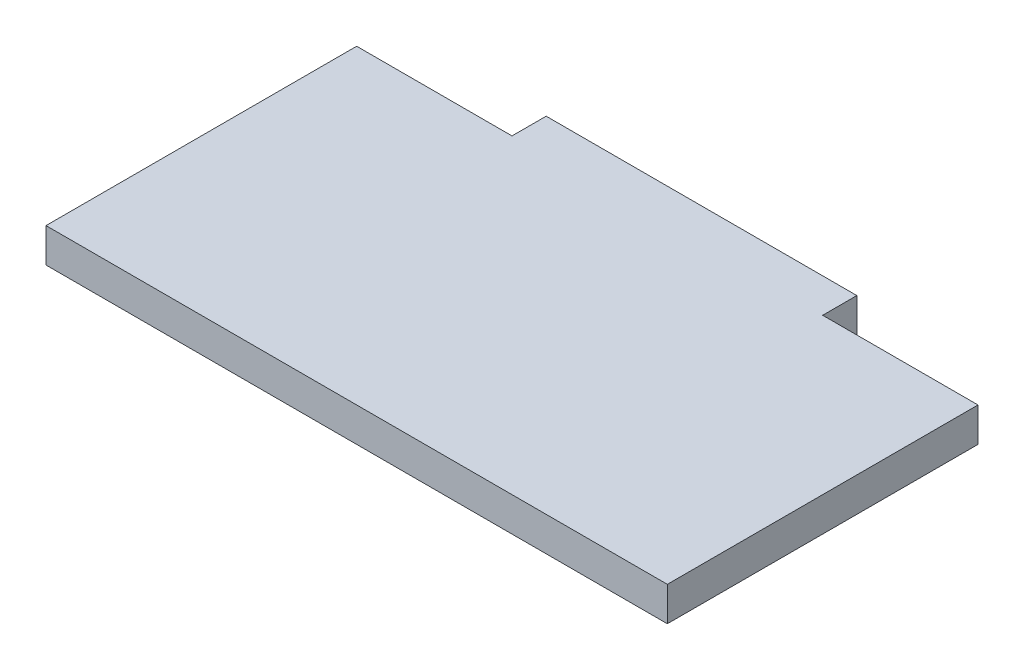
ISO-10303-21;
HEADER;
FILE_DESCRIPTION(('STEP AP214'),'2;1');
FILE_NAME('part.step','',(''),(''),'','','');
FILE_SCHEMA(('AUTOMOTIVE_DESIGN { 1 0 10303 214 1 1 1 1 }'));
ENDSEC;
DATA;
#1=APPLICATION_CONTEXT('core data for automotive mechanical design processes');
#2=APPLICATION_PROTOCOL_DEFINITION('international standard','automotive_design',2000,#1);
#3=PRODUCT_CONTEXT('',#1,'mechanical');
#4=PRODUCT('Part','Part','',(#3));
#5=PRODUCT_RELATED_PRODUCT_CATEGORY('part','',(#4));
#6=PRODUCT_DEFINITION_FORMATION('','',#4);
#7=PRODUCT_DEFINITION_CONTEXT('part definition',#1,'design');
#8=PRODUCT_DEFINITION('design','',#6,#7);
#9=PRODUCT_DEFINITION_SHAPE('','',#8);
#10=(LENGTH_UNIT() NAMED_UNIT(*) SI_UNIT(.MILLI.,.METRE.));
#11=(NAMED_UNIT(*) PLANE_ANGLE_UNIT() SI_UNIT($,.RADIAN.));
#12=(NAMED_UNIT(*) SI_UNIT($,.STERADIAN.) SOLID_ANGLE_UNIT());
#13=UNCERTAINTY_MEASURE_WITH_UNIT(LENGTH_MEASURE(1.E-05),#10,'distance_accuracy_value','');
#14=(GEOMETRIC_REPRESENTATION_CONTEXT(3) GLOBAL_UNCERTAINTY_ASSIGNED_CONTEXT((#13)) GLOBAL_UNIT_ASSIGNED_CONTEXT((#10,
#11,#12)) REPRESENTATION_CONTEXT('',''));
#15=CARTESIAN_POINT('',(0.,0.,0.));
#16=DIRECTION('',(0.,0.,1.));
#17=DIRECTION('',(1.,0.,0.));
#18=AXIS2_PLACEMENT_3D('',#15,#16,#17);
#19=CARTESIAN_POINT('',(0.,2.794,0.));
#20=DIRECTION('',(1.,0.,0.));
#21=DIRECTION('',(0.,0.,-1.));
#22=AXIS2_PLACEMENT_3D('',#19,#20,#21);
#23=PLANE('',#22);
#24=DIRECTION('',(0.,0.,1.));
#25=VECTOR('',#24,1.);
#26=CARTESIAN_POINT('',(0.,0.,0.));
#27=LINE('',#26,#25);
#28=CARTESIAN_POINT('',(0.,0.,-25.4));
#29=VERTEX_POINT('',#28);
#30=CARTESIAN_POINT('',(0.,0.,0.));
#31=VERTEX_POINT('',#30);
#32=EDGE_CURVE('E129',#29,#31,#27,.T.);
#33=ORIENTED_EDGE('',*,*,#32,.T.);
#34=DIRECTION('',(0.,-1.,0.));
#35=VECTOR('',#34,1.);
#36=CARTESIAN_POINT('',(0.,2.794,0.));
#37=LINE('',#36,#35);
#38=CARTESIAN_POINT('',(0.,2.794,0.));
#39=VERTEX_POINT('',#38);
#40=EDGE_CURVE('E11',#39,#31,#37,.T.);
#41=ORIENTED_EDGE('',*,*,#40,.F.);
#42=DIRECTION('',(0.,0.,1.));
#43=VECTOR('',#42,1.);
#44=CARTESIAN_POINT('',(0.,2.794,0.));
#45=LINE('',#44,#43);
#46=CARTESIAN_POINT('',(0.,2.794,-25.4));
#47=VERTEX_POINT('',#46);
#48=EDGE_CURVE('E143',#47,#39,#45,.T.);
#49=ORIENTED_EDGE('',*,*,#48,.F.);
#50=DIRECTION('',(0.,-1.,0.));
#51=VECTOR('',#50,1.);
#52=CARTESIAN_POINT('',(0.,2.794,-25.4));
#53=LINE('',#52,#51);
#54=EDGE_CURVE('E125',#47,#29,#53,.T.);
#55=ORIENTED_EDGE('',*,*,#54,.T.);
#56=EDGE_LOOP('',(#33,#41,#49,#55));
#57=FACE_BOUND('',#56,.T.);
#58=ADVANCED_FACE('F33',(#57),#23,.F.);
#59=CARTESIAN_POINT('',(0.,2.794,0.));
#60=DIRECTION('',(0.,0.,-1.));
#61=DIRECTION('',(-1.,0.,0.));
#62=AXIS2_PLACEMENT_3D('',#59,#60,#61);
#63=PLANE('',#62);
#64=DIRECTION('',(1.,0.,0.));
#65=VECTOR('',#64,1.);
#66=CARTESIAN_POINT('',(0.,0.,0.));
#67=LINE('',#66,#65);
#68=CARTESIAN_POINT('',(50.8,0.,0.));
#69=VERTEX_POINT('',#68);
#70=EDGE_CURVE('E132',#31,#69,#67,.T.);
#71=ORIENTED_EDGE('',*,*,#70,.T.);
#72=DIRECTION('',(0.,-1.,0.));
#73=VECTOR('',#72,1.);
#74=CARTESIAN_POINT('',(50.8,2.794,0.));
#75=LINE('',#74,#73);
#76=CARTESIAN_POINT('',(50.8,2.794,0.));
#77=VERTEX_POINT('',#76);
#78=EDGE_CURVE('E41',#77,#69,#75,.T.);
#79=ORIENTED_EDGE('',*,*,#78,.F.);
#80=DIRECTION('',(1.,0.,0.));
#81=VECTOR('',#80,1.);
#82=CARTESIAN_POINT('',(0.,2.794,0.));
#83=LINE('',#82,#81);
#84=EDGE_CURVE('E92',#39,#77,#83,.T.);
#85=ORIENTED_EDGE('',*,*,#84,.F.);
#86=ORIENTED_EDGE('',*,*,#40,.T.);
#87=EDGE_LOOP('',(#71,#79,#85,#86));
#88=FACE_BOUND('',#87,.T.);
#89=ADVANCED_FACE('F178',(#88),#63,.F.);
#90=CARTESIAN_POINT('',(50.8,2.794,0.));
#91=DIRECTION('',(-1.,0.,0.));
#92=DIRECTION('',(0.,0.,1.));
#93=AXIS2_PLACEMENT_3D('',#90,#91,#92);
#94=PLANE('',#93);
#95=DIRECTION('',(0.,0.,-1.));
#96=VECTOR('',#95,1.);
#97=CARTESIAN_POINT('',(50.8,0.,0.));
#98=LINE('',#97,#96);
#99=CARTESIAN_POINT('',(50.8,0.,-25.4));
#100=VERTEX_POINT('',#99);
#101=EDGE_CURVE('E134',#69,#100,#98,.T.);
#102=ORIENTED_EDGE('',*,*,#101,.T.);
#103=DIRECTION('',(0.,-1.,0.));
#104=VECTOR('',#103,1.);
#105=CARTESIAN_POINT('',(50.8,2.794,-25.4));
#106=LINE('',#105,#104);
#107=CARTESIAN_POINT('',(50.8,2.794,-25.4));
#108=VERTEX_POINT('',#107);
#109=EDGE_CURVE('E150',#108,#100,#106,.T.);
#110=ORIENTED_EDGE('',*,*,#109,.F.);
#111=DIRECTION('',(0.,0.,-1.));
#112=VECTOR('',#111,1.);
#113=CARTESIAN_POINT('',(50.8,2.794,0.));
#114=LINE('',#113,#112);
#115=EDGE_CURVE('E158',#77,#108,#114,.T.);
#116=ORIENTED_EDGE('',*,*,#115,.F.);
#117=ORIENTED_EDGE('',*,*,#78,.T.);
#118=EDGE_LOOP('',(#102,#110,#116,#117));
#119=FACE_BOUND('',#118,.T.);
#120=ADVANCED_FACE('F156',(#119),#94,.F.);
#121=CARTESIAN_POINT('',(38.1,2.794,-25.4));
#122=DIRECTION('',(0.,0.,1.));
#123=DIRECTION('',(1.,0.,0.));
#124=AXIS2_PLACEMENT_3D('',#121,#122,#123);
#125=PLANE('',#124);
#126=DIRECTION('',(-1.,0.,0.));
#127=VECTOR('',#126,1.);
#128=CARTESIAN_POINT('',(38.1,0.,-25.4));
#129=LINE('',#128,#127);
#130=CARTESIAN_POINT('',(38.1,0.,-25.4));
#131=VERTEX_POINT('',#130);
#132=EDGE_CURVE('E136',#100,#131,#129,.T.);
#133=ORIENTED_EDGE('',*,*,#132,.T.);
#134=DIRECTION('',(0.,-1.,0.));
#135=VECTOR('',#134,1.);
#136=CARTESIAN_POINT('',(38.1,2.794,-25.4));
#137=LINE('',#136,#135);
#138=CARTESIAN_POINT('',(38.1,2.794,-25.4));
#139=VERTEX_POINT('',#138);
#140=EDGE_CURVE('E147',#139,#131,#137,.T.);
#141=ORIENTED_EDGE('',*,*,#140,.F.);
#142=DIRECTION('',(-1.,0.,0.));
#143=VECTOR('',#142,1.);
#144=CARTESIAN_POINT('',(38.1,2.794,-25.4));
#145=LINE('',#144,#143);
#146=EDGE_CURVE('E170',#108,#139,#145,.T.);
#147=ORIENTED_EDGE('',*,*,#146,.F.);
#148=ORIENTED_EDGE('',*,*,#109,.T.);
#149=EDGE_LOOP('',(#133,#141,#147,#148));
#150=FACE_BOUND('',#149,.T.);
#151=ADVANCED_FACE('F166',(#150),#125,.F.);
#152=CARTESIAN_POINT('',(38.1,2.794,-28.194));
#153=DIRECTION('',(-1.,0.,0.));
#154=DIRECTION('',(0.,0.,1.));
#155=AXIS2_PLACEMENT_3D('',#152,#153,#154);
#156=PLANE('',#155);
#157=DIRECTION('',(0.,0.,-1.));
#158=VECTOR('',#157,1.);
#159=CARTESIAN_POINT('',(38.1,0.,-28.194));
#160=LINE('',#159,#158);
#161=CARTESIAN_POINT('',(38.1,0.,-28.194));
#162=VERTEX_POINT('',#161);
#163=EDGE_CURVE('E138',#131,#162,#160,.T.);
#164=ORIENTED_EDGE('',*,*,#163,.T.);
#165=DIRECTION('',(0.,-1.,0.));
#166=VECTOR('',#165,1.);
#167=CARTESIAN_POINT('',(38.1,2.794,-28.194));
#168=LINE('',#167,#166);
#169=CARTESIAN_POINT('',(38.1,2.794,-28.194));
#170=VERTEX_POINT('',#169);
#171=EDGE_CURVE('E120',#170,#162,#168,.T.);
#172=ORIENTED_EDGE('',*,*,#171,.F.);
#173=DIRECTION('',(0.,0.,-1.));
#174=VECTOR('',#173,1.);
#175=CARTESIAN_POINT('',(38.1,2.794,-28.194));
#176=LINE('',#175,#174);
#177=EDGE_CURVE('E111',#139,#170,#176,.T.);
#178=ORIENTED_EDGE('',*,*,#177,.F.);
#179=ORIENTED_EDGE('',*,*,#140,.T.);
#180=EDGE_LOOP('',(#164,#172,#178,#179));
#181=FACE_BOUND('',#180,.T.);
#182=ADVANCED_FACE('F169',(#181),#156,.F.);
#183=CARTESIAN_POINT('',(12.7,2.794,-28.194));
#184=DIRECTION('',(0.,0.,1.));
#185=DIRECTION('',(1.,0.,0.));
#186=AXIS2_PLACEMENT_3D('',#183,#184,#185);
#187=PLANE('',#186);
#188=DIRECTION('',(-1.,0.,0.));
#189=VECTOR('',#188,1.);
#190=CARTESIAN_POINT('',(12.7,0.,-28.194));
#191=LINE('',#190,#189);
#192=CARTESIAN_POINT('',(12.7,0.,-28.194));
#193=VERTEX_POINT('',#192);
#194=EDGE_CURVE('E119',#162,#193,#191,.T.);
#195=ORIENTED_EDGE('',*,*,#194,.T.);
#196=DIRECTION('',(0.,-1.,0.));
#197=VECTOR('',#196,1.);
#198=CARTESIAN_POINT('',(12.7,2.794,-28.194));
#199=LINE('',#198,#197);
#200=CARTESIAN_POINT('',(12.7,2.794,-28.194));
#201=VERTEX_POINT('',#200);
#202=EDGE_CURVE('E116',#201,#193,#199,.T.);
#203=ORIENTED_EDGE('',*,*,#202,.F.);
#204=DIRECTION('',(-1.,0.,0.));
#205=VECTOR('',#204,1.);
#206=CARTESIAN_POINT('',(12.7,2.794,-28.194));
#207=LINE('',#206,#205);
#208=EDGE_CURVE('E105',#170,#201,#207,.T.);
#209=ORIENTED_EDGE('',*,*,#208,.F.);
#210=ORIENTED_EDGE('',*,*,#171,.T.);
#211=EDGE_LOOP('',(#195,#203,#209,#210));
#212=FACE_BOUND('',#211,.T.);
#213=ADVANCED_FACE('F117',(#212),#187,.F.);
#214=CARTESIAN_POINT('',(12.7,2.794,-28.194));
#215=DIRECTION('',(1.,0.,0.));
#216=DIRECTION('',(0.,0.,-1.));
#217=AXIS2_PLACEMENT_3D('',#214,#215,#216);
#218=PLANE('',#217);
#219=DIRECTION('',(0.,0.,1.));
#220=VECTOR('',#219,1.);
#221=CARTESIAN_POINT('',(12.7,0.,-28.194));
#222=LINE('',#221,#220);
#223=CARTESIAN_POINT('',(12.7,0.,-25.4));
#224=VERTEX_POINT('',#223);
#225=EDGE_CURVE('E78',#193,#224,#222,.T.);
#226=ORIENTED_EDGE('',*,*,#225,.T.);
#227=DIRECTION('',(0.,-1.,0.));
#228=VECTOR('',#227,1.);
#229=CARTESIAN_POINT('',(12.7,2.794,-25.4));
#230=LINE('',#229,#228);
#231=CARTESIAN_POINT('',(12.7,2.794,-25.4));
#232=VERTEX_POINT('',#231);
#233=EDGE_CURVE('E121',#232,#224,#230,.T.);
#234=ORIENTED_EDGE('',*,*,#233,.F.);
#235=DIRECTION('',(0.,0.,1.));
#236=VECTOR('',#235,1.);
#237=CARTESIAN_POINT('',(12.7,2.794,-28.194));
#238=LINE('',#237,#236);
#239=EDGE_CURVE('E109',#201,#232,#238,.T.);
#240=ORIENTED_EDGE('',*,*,#239,.F.);
#241=ORIENTED_EDGE('',*,*,#202,.T.);
#242=EDGE_LOOP('',(#226,#234,#240,#241));
#243=FACE_BOUND('',#242,.T.);
#244=ADVANCED_FACE('F123',(#243),#218,.F.);
#245=CARTESIAN_POINT('',(0.,2.794,-25.4));
#246=DIRECTION('',(0.,0.,1.));
#247=DIRECTION('',(1.,0.,0.));
#248=AXIS2_PLACEMENT_3D('',#245,#246,#247);
#249=PLANE('',#248);
#250=DIRECTION('',(-1.,0.,0.));
#251=VECTOR('',#250,1.);
#252=CARTESIAN_POINT('',(0.,0.,-25.4));
#253=LINE('',#252,#251);
#254=EDGE_CURVE('E84',#224,#29,#253,.T.);
#255=ORIENTED_EDGE('',*,*,#254,.T.);
#256=ORIENTED_EDGE('',*,*,#54,.F.);
#257=DIRECTION('',(-1.,0.,0.));
#258=VECTOR('',#257,1.);
#259=CARTESIAN_POINT('',(0.,2.794,-25.4));
#260=LINE('',#259,#258);
#261=EDGE_CURVE('E49',#232,#47,#260,.T.);
#262=ORIENTED_EDGE('',*,*,#261,.F.);
#263=ORIENTED_EDGE('',*,*,#233,.T.);
#264=EDGE_LOOP('',(#255,#256,#262,#263));
#265=FACE_BOUND('',#264,.T.);
#266=ADVANCED_FACE('F194',(#265),#249,.F.);
#267=CARTESIAN_POINT('',(0.,2.794,0.));
#268=DIRECTION('',(0.,-1.,0.));
#269=DIRECTION('',(0.,0.,-1.));
#270=AXIS2_PLACEMENT_3D('',#267,#268,#269);
#271=PLANE('',#270);
#272=ORIENTED_EDGE('',*,*,#48,.T.);
#273=ORIENTED_EDGE('',*,*,#84,.T.);
#274=ORIENTED_EDGE('',*,*,#115,.T.);
#275=ORIENTED_EDGE('',*,*,#146,.T.);
#276=ORIENTED_EDGE('',*,*,#177,.T.);
#277=ORIENTED_EDGE('',*,*,#208,.T.);
#278=ORIENTED_EDGE('',*,*,#239,.T.);
#279=ORIENTED_EDGE('',*,*,#261,.T.);
#280=EDGE_LOOP('',(#272,#273,#274,#275,#276,#277,#278,#279));
#281=FACE_BOUND('',#280,.T.);
#282=ADVANCED_FACE('F107',(#281),#271,.F.);
#283=CARTESIAN_POINT('',(0.,0.,0.));
#284=DIRECTION('',(0.,-1.,0.));
#285=DIRECTION('',(0.,0.,-1.));
#286=AXIS2_PLACEMENT_3D('',#283,#284,#285);
#287=PLANE('',#286);
#288=ORIENTED_EDGE('',*,*,#32,.F.);
#289=ORIENTED_EDGE('',*,*,#254,.F.);
#290=ORIENTED_EDGE('',*,*,#225,.F.);
#291=ORIENTED_EDGE('',*,*,#194,.F.);
#292=ORIENTED_EDGE('',*,*,#163,.F.);
#293=ORIENTED_EDGE('',*,*,#132,.F.);
#294=ORIENTED_EDGE('',*,*,#101,.F.);
#295=ORIENTED_EDGE('',*,*,#70,.F.);
#296=EDGE_LOOP('',(#288,#289,#290,#291,#292,#293,#294,#295));
#297=FACE_BOUND('',#296,.T.);
#298=ADVANCED_FACE('F162',(#297),#287,.T.);
#299=CLOSED_SHELL('',(#58,#89,#120,#151,#182,#213,#244,#266,#282,#298));
#300=MANIFOLD_SOLID_BREP('B2',#299);
#301=ADVANCED_BREP_SHAPE_REPRESENTATION('',(#18,#300),#14);
#302=SHAPE_DEFINITION_REPRESENTATION(#9,#301);
ENDSEC;
END-ISO-10303-21;
